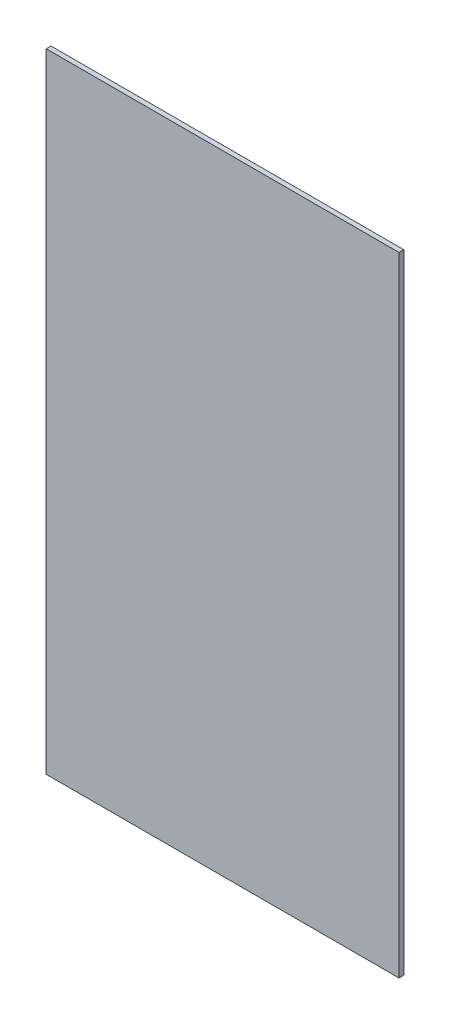
ISO-10303-21;
HEADER;
FILE_DESCRIPTION(('STEP AP214'),'2;1');
FILE_NAME('part.step','',(''),(''),'','','');
FILE_SCHEMA(('AUTOMOTIVE_DESIGN { 1 0 10303 214 1 1 1 1 }'));
ENDSEC;
DATA;
#1=APPLICATION_CONTEXT('core data for automotive mechanical design processes');
#2=APPLICATION_PROTOCOL_DEFINITION('international standard','automotive_design',2000,#1);
#3=PRODUCT_CONTEXT('',#1,'mechanical');
#4=PRODUCT('Part','Part','',(#3));
#5=PRODUCT_RELATED_PRODUCT_CATEGORY('part','',(#4));
#6=PRODUCT_DEFINITION_FORMATION('','',#4);
#7=PRODUCT_DEFINITION_CONTEXT('part definition',#1,'design');
#8=PRODUCT_DEFINITION('design','',#6,#7);
#9=PRODUCT_DEFINITION_SHAPE('','',#8);
#10=(LENGTH_UNIT() NAMED_UNIT(*) SI_UNIT(.MILLI.,.METRE.));
#11=(NAMED_UNIT(*) PLANE_ANGLE_UNIT() SI_UNIT($,.RADIAN.));
#12=(NAMED_UNIT(*) SI_UNIT($,.STERADIAN.) SOLID_ANGLE_UNIT());
#13=UNCERTAINTY_MEASURE_WITH_UNIT(LENGTH_MEASURE(1.E-05),#10,'distance_accuracy_value','');
#14=(GEOMETRIC_REPRESENTATION_CONTEXT(3) GLOBAL_UNCERTAINTY_ASSIGNED_CONTEXT((#13)) GLOBAL_UNIT_ASSIGNED_CONTEXT((#10,
#11,#12)) REPRESENTATION_CONTEXT('',''));
#15=CARTESIAN_POINT('',(0.,0.,0.));
#16=DIRECTION('',(0.,0.,1.));
#17=DIRECTION('',(1.,0.,0.));
#18=AXIS2_PLACEMENT_3D('',#15,#16,#17);
#19=CARTESIAN_POINT('',(0.,0.,1.51892));
#20=DIRECTION('',(1.,0.,0.));
#21=DIRECTION('',(0.,0.,-1.));
#22=AXIS2_PLACEMENT_3D('',#19,#20,#21);
#23=PLANE('',#22);
#24=DIRECTION('',(0.,-1.,0.));
#25=VECTOR('',#24,1.);
#26=CARTESIAN_POINT('',(0.,0.,0.));
#27=LINE('',#26,#25);
#28=CARTESIAN_POINT('',(0.,200.,0.));
#29=VERTEX_POINT('',#28);
#30=CARTESIAN_POINT('',(0.,0.,0.));
#31=VERTEX_POINT('',#30);
#32=EDGE_CURVE('E97',#29,#31,#27,.T.);
#33=ORIENTED_EDGE('',*,*,#32,.T.);
#34=DIRECTION('',(0.,0.,-1.));
#35=VECTOR('',#34,1.);
#36=CARTESIAN_POINT('',(0.,0.,1.51892));
#37=LINE('',#36,#35);
#38=CARTESIAN_POINT('',(0.,0.,1.51892));
#39=VERTEX_POINT('',#38);
#40=EDGE_CURVE('E11',#39,#31,#37,.T.);
#41=ORIENTED_EDGE('',*,*,#40,.F.);
#42=DIRECTION('',(0.,-1.,0.));
#43=VECTOR('',#42,1.);
#44=CARTESIAN_POINT('',(0.,0.,1.51892));
#45=LINE('',#44,#43);
#46=CARTESIAN_POINT('',(0.,200.,1.51892));
#47=VERTEX_POINT('',#46);
#48=EDGE_CURVE('E85',#47,#39,#45,.T.);
#49=ORIENTED_EDGE('',*,*,#48,.F.);
#50=DIRECTION('',(0.,0.,-1.));
#51=VECTOR('',#50,1.);
#52=CARTESIAN_POINT('',(0.,200.,1.51892));
#53=LINE('',#52,#51);
#54=EDGE_CURVE('E93',#47,#29,#53,.T.);
#55=ORIENTED_EDGE('',*,*,#54,.T.);
#56=EDGE_LOOP('',(#33,#41,#49,#55));
#57=FACE_BOUND('',#56,.T.);
#58=ADVANCED_FACE('F34',(#57),#23,.F.);
#59=CARTESIAN_POINT('',(0.,0.,1.51892));
#60=DIRECTION('',(0.,1.,0.));
#61=DIRECTION('',(0.,0.,1.));
#62=AXIS2_PLACEMENT_3D('',#59,#60,#61);
#63=PLANE('',#62);
#64=DIRECTION('',(1.,0.,0.));
#65=VECTOR('',#64,1.);
#66=CARTESIAN_POINT('',(0.,0.,0.));
#67=LINE('',#66,#65);
#68=CARTESIAN_POINT('',(112.268,0.,0.));
#69=VERTEX_POINT('',#68);
#70=EDGE_CURVE('E89',#31,#69,#67,.T.);
#71=ORIENTED_EDGE('',*,*,#70,.T.);
#72=DIRECTION('',(0.,0.,-1.));
#73=VECTOR('',#72,1.);
#74=CARTESIAN_POINT('',(112.268,0.,1.51892));
#75=LINE('',#74,#73);
#76=CARTESIAN_POINT('',(112.268,0.,1.51892));
#77=VERTEX_POINT('',#76);
#78=EDGE_CURVE('E42',#77,#69,#75,.T.);
#79=ORIENTED_EDGE('',*,*,#78,.F.);
#80=DIRECTION('',(1.,0.,0.));
#81=VECTOR('',#80,1.);
#82=CARTESIAN_POINT('',(0.,0.,1.51892));
#83=LINE('',#82,#81);
#84=EDGE_CURVE('E80',#39,#77,#83,.T.);
#85=ORIENTED_EDGE('',*,*,#84,.F.);
#86=ORIENTED_EDGE('',*,*,#40,.T.);
#87=EDGE_LOOP('',(#71,#79,#85,#86));
#88=FACE_BOUND('',#87,.T.);
#89=ADVANCED_FACE('F88',(#88),#63,.F.);
#90=CARTESIAN_POINT('',(112.268,0.,1.51892));
#91=DIRECTION('',(-1.,0.,0.));
#92=DIRECTION('',(0.,0.,1.));
#93=AXIS2_PLACEMENT_3D('',#90,#91,#92);
#94=PLANE('',#93);
#95=DIRECTION('',(0.,1.,0.));
#96=VECTOR('',#95,1.);
#97=CARTESIAN_POINT('',(112.268,0.,0.));
#98=LINE('',#97,#96);
#99=CARTESIAN_POINT('',(112.268,200.,0.));
#100=VERTEX_POINT('',#99);
#101=EDGE_CURVE('E67',#69,#100,#98,.T.);
#102=ORIENTED_EDGE('',*,*,#101,.T.);
#103=DIRECTION('',(0.,0.,-1.));
#104=VECTOR('',#103,1.);
#105=CARTESIAN_POINT('',(112.268,200.,1.51892));
#106=LINE('',#105,#104);
#107=CARTESIAN_POINT('',(112.268,200.,1.51892));
#108=VERTEX_POINT('',#107);
#109=EDGE_CURVE('E90',#108,#100,#106,.T.);
#110=ORIENTED_EDGE('',*,*,#109,.F.);
#111=DIRECTION('',(0.,1.,0.));
#112=VECTOR('',#111,1.);
#113=CARTESIAN_POINT('',(112.268,0.,1.51892));
#114=LINE('',#113,#112);
#115=EDGE_CURVE('E83',#77,#108,#114,.T.);
#116=ORIENTED_EDGE('',*,*,#115,.F.);
#117=ORIENTED_EDGE('',*,*,#78,.T.);
#118=EDGE_LOOP('',(#102,#110,#116,#117));
#119=FACE_BOUND('',#118,.T.);
#120=ADVANCED_FACE('F91',(#119),#94,.F.);
#121=CARTESIAN_POINT('',(0.,200.,1.51892));
#122=DIRECTION('',(0.,-1.,0.));
#123=DIRECTION('',(0.,0.,-1.));
#124=AXIS2_PLACEMENT_3D('',#121,#122,#123);
#125=PLANE('',#124);
#126=DIRECTION('',(-1.,0.,0.));
#127=VECTOR('',#126,1.);
#128=CARTESIAN_POINT('',(0.,200.,0.));
#129=LINE('',#128,#127);
#130=EDGE_CURVE('E73',#100,#29,#129,.T.);
#131=ORIENTED_EDGE('',*,*,#130,.T.);
#132=ORIENTED_EDGE('',*,*,#54,.F.);
#133=DIRECTION('',(-1.,0.,0.));
#134=VECTOR('',#133,1.);
#135=CARTESIAN_POINT('',(0.,200.,1.51892));
#136=LINE('',#135,#134);
#137=EDGE_CURVE('E50',#108,#47,#136,.T.);
#138=ORIENTED_EDGE('',*,*,#137,.F.);
#139=ORIENTED_EDGE('',*,*,#109,.T.);
#140=EDGE_LOOP('',(#131,#132,#138,#139));
#141=FACE_BOUND('',#140,.T.);
#142=ADVANCED_FACE('F104',(#141),#125,.F.);
#143=CARTESIAN_POINT('',(0.,0.,1.51892));
#144=DIRECTION('',(0.,0.,-1.));
#145=DIRECTION('',(-1.,0.,0.));
#146=AXIS2_PLACEMENT_3D('',#143,#144,#145);
#147=PLANE('',#146);
#148=ORIENTED_EDGE('',*,*,#48,.T.);
#149=ORIENTED_EDGE('',*,*,#84,.T.);
#150=ORIENTED_EDGE('',*,*,#115,.T.);
#151=ORIENTED_EDGE('',*,*,#137,.T.);
#152=EDGE_LOOP('',(#148,#149,#150,#151));
#153=FACE_BOUND('',#152,.T.);
#154=ADVANCED_FACE('F81',(#153),#147,.F.);
#155=CARTESIAN_POINT('',(0.,0.,0.));
#156=DIRECTION('',(0.,0.,-1.));
#157=DIRECTION('',(-1.,0.,0.));
#158=AXIS2_PLACEMENT_3D('',#155,#156,#157);
#159=PLANE('',#158);
#160=ORIENTED_EDGE('',*,*,#32,.F.);
#161=ORIENTED_EDGE('',*,*,#130,.F.);
#162=ORIENTED_EDGE('',*,*,#101,.F.);
#163=ORIENTED_EDGE('',*,*,#70,.F.);
#164=EDGE_LOOP('',(#160,#161,#162,#163));
#165=FACE_BOUND('',#164,.T.);
#166=ADVANCED_FACE('F107',(#165),#159,.T.);
#167=CLOSED_SHELL('',(#58,#89,#120,#142,#154,#166));
#168=MANIFOLD_SOLID_BREP('B2',#167);
#169=ADVANCED_BREP_SHAPE_REPRESENTATION('',(#18,#168),#14);
#170=SHAPE_DEFINITION_REPRESENTATION(#9,#169);
ENDSEC;
END-ISO-10303-21;
